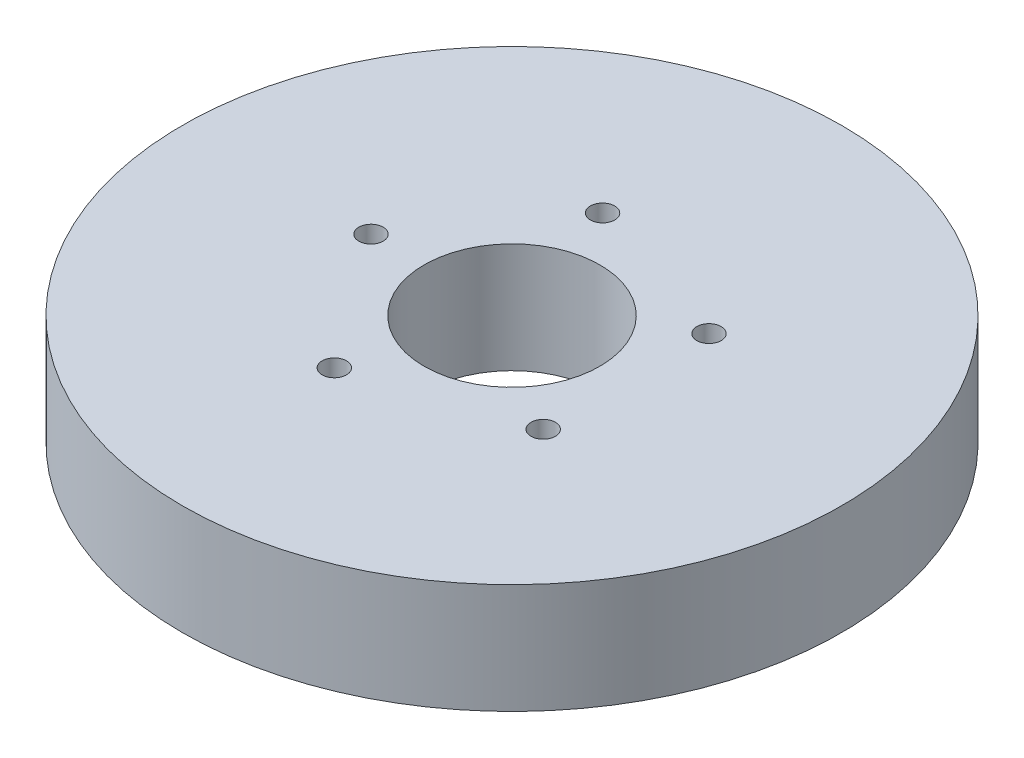
ISO-10303-21;
HEADER;
FILE_DESCRIPTION(('STEP AP214'),'2;1');
FILE_NAME('part.step','',(''),(''),'','','');
FILE_SCHEMA(('AUTOMOTIVE_DESIGN { 1 0 10303 214 1 1 1 1 }'));
ENDSEC;
DATA;
#1=APPLICATION_CONTEXT('core data for automotive mechanical design processes');
#2=APPLICATION_PROTOCOL_DEFINITION('international standard','automotive_design',2000,#1);
#3=PRODUCT_CONTEXT('',#1,'mechanical');
#4=PRODUCT('Part','Part','',(#3));
#5=PRODUCT_RELATED_PRODUCT_CATEGORY('part','',(#4));
#6=PRODUCT_DEFINITION_FORMATION('','',#4);
#7=PRODUCT_DEFINITION_CONTEXT('part definition',#1,'design');
#8=PRODUCT_DEFINITION('design','',#6,#7);
#9=PRODUCT_DEFINITION_SHAPE('','',#8);
#10=(LENGTH_UNIT() NAMED_UNIT(*) SI_UNIT(.MILLI.,.METRE.));
#11=(NAMED_UNIT(*) PLANE_ANGLE_UNIT() SI_UNIT($,.RADIAN.));
#12=(NAMED_UNIT(*) SI_UNIT($,.STERADIAN.) SOLID_ANGLE_UNIT());
#13=UNCERTAINTY_MEASURE_WITH_UNIT(LENGTH_MEASURE(1.E-05),#10,'distance_accuracy_value','');
#14=(GEOMETRIC_REPRESENTATION_CONTEXT(3) GLOBAL_UNCERTAINTY_ASSIGNED_CONTEXT((#13)) GLOBAL_UNIT_ASSIGNED_CONTEXT((#10,
#11,#12)) REPRESENTATION_CONTEXT('',''));
#15=CARTESIAN_POINT('',(0.,0.,0.));
#16=DIRECTION('',(0.,0.,1.));
#17=DIRECTION('',(1.,0.,0.));
#18=AXIS2_PLACEMENT_3D('',#15,#16,#17);
#19=CARTESIAN_POINT('',(0.,25.,0.));
#20=DIRECTION('',(0.,-1.,0.));
#21=DIRECTION('',(0.,0.,-1.));
#22=AXIS2_PLACEMENT_3D('',#19,#20,#21);
#23=CYLINDRICAL_SURFACE('',#22,75.);
#24=CARTESIAN_POINT('',(0.,25.,0.));
#25=DIRECTION('',(0.,1.,0.));
#26=DIRECTION('',(0.,0.,1.));
#27=AXIS2_PLACEMENT_3D('',#24,#25,#26);
#28=CIRCLE('',#27,75.);
#29=CARTESIAN_POINT('',(0.,25.,75.));
#30=VERTEX_POINT('',#29);
#31=EDGE_CURVE('E10',#30,#30,#28,.T.);
#32=ORIENTED_EDGE('',*,*,#31,.F.);
#33=EDGE_LOOP('',(#32));
#34=FACE_BOUND('',#33,.T.);
#35=CARTESIAN_POINT('',(0.,0.,0.));
#36=DIRECTION('',(0.,1.,0.));
#37=DIRECTION('',(0.,0.,1.));
#38=AXIS2_PLACEMENT_3D('',#35,#36,#37);
#39=CIRCLE('',#38,75.);
#40=CARTESIAN_POINT('',(0.,0.,75.));
#41=VERTEX_POINT('',#40);
#42=EDGE_CURVE('E37',#41,#41,#39,.T.);
#43=ORIENTED_EDGE('',*,*,#42,.T.);
#44=EDGE_LOOP('',(#43));
#45=FACE_BOUND('',#44,.T.);
#46=ADVANCED_FACE('F40',(#34,#45),#23,.T.);
#47=CARTESIAN_POINT('',(0.,25.,0.));
#48=DIRECTION('',(0.,1.,0.));
#49=DIRECTION('',(0.,0.,1.));
#50=AXIS2_PLACEMENT_3D('',#47,#48,#49);
#51=PLANE('',#50);
#52=CARTESIAN_POINT('',(-9.91726015513193,25.,30.5221883133339));
#53=DIRECTION('',(0.,1.,0.));
#54=DIRECTION('',(0.951056516295155,0.,0.309016994374945));
#55=AXIS2_PLACEMENT_3D('',#52,#53,#54);
#56=CIRCLE('',#55,2.77384865878085);
#57=CARTESIAN_POINT('',(-9.91726015513193,25.,33.2960369721148));
#58=VERTEX_POINT('',#57);
#59=EDGE_CURVE('E78',#58,#58,#56,.T.);
#60=ORIENTED_EDGE('',*,*,#59,.F.);
#61=EDGE_LOOP('',(#60));
#62=FACE_BOUND('',#61,.T.);
#63=CARTESIAN_POINT('',(25.9637241614108,25.,18.863749788665));
#64=DIRECTION('',(0.,1.,0.));
#65=DIRECTION('',(0.587785252292469,0.,-0.809016994374951));
#66=AXIS2_PLACEMENT_3D('',#63,#64,#65);
#67=CIRCLE('',#66,2.77384865878085);
#68=CARTESIAN_POINT('',(25.9637241614108,25.,21.6375984474459));
#69=VERTEX_POINT('',#68);
#70=EDGE_CURVE('E71',#69,#69,#67,.T.);
#71=ORIENTED_EDGE('',*,*,#70,.F.);
#72=EDGE_LOOP('',(#71));
#73=FACE_BOUND('',#72,.T.);
#74=CARTESIAN_POINT('',(25.9637241614105,25.,-18.8637497886654));
#75=DIRECTION('',(0.,1.,0.));
#76=DIRECTION('',(-0.58778525229248,0.,-0.809016994374942));
#77=AXIS2_PLACEMENT_3D('',#74,#75,#76);
#78=CIRCLE('',#77,2.77384865878085);
#79=CARTESIAN_POINT('',(25.9637241614105,25.,-16.0899011298846));
#80=VERTEX_POINT('',#79);
#81=EDGE_CURVE('E70',#80,#80,#78,.T.);
#82=ORIENTED_EDGE('',*,*,#81,.F.);
#83=EDGE_LOOP('',(#82));
#84=FACE_BOUND('',#83,.T.);
#85=CARTESIAN_POINT('',(-9.91726015513237,25.,-30.5221883133338));
#86=DIRECTION('',(0.,1.,0.));
#87=DIRECTION('',(-0.95105651629515,0.,0.309016994374958));
#88=AXIS2_PLACEMENT_3D('',#85,#86,#87);
#89=CIRCLE('',#88,2.77384865878085);
#90=CARTESIAN_POINT('',(-9.91726015513237,25.,-27.748339654553));
#91=VERTEX_POINT('',#90);
#92=EDGE_CURVE('E61',#91,#91,#89,.T.);
#93=ORIENTED_EDGE('',*,*,#92,.F.);
#94=EDGE_LOOP('',(#93));
#95=FACE_BOUND('',#94,.T.);
#96=CARTESIAN_POINT('',(-32.0929280125573,25.,0.));
#97=DIRECTION('',(0.,1.,0.));
#98=DIRECTION('',(0.,0.,1.));
#99=AXIS2_PLACEMENT_3D('',#96,#97,#98);
#100=CIRCLE('',#99,2.77384865878085);
#101=CARTESIAN_POINT('',(-32.0929280125573,25.,2.77384865878085));
#102=VERTEX_POINT('',#101);
#103=EDGE_CURVE('E54',#102,#102,#100,.T.);
#104=ORIENTED_EDGE('',*,*,#103,.F.);
#105=EDGE_LOOP('',(#104));
#106=FACE_BOUND('',#105,.T.);
#107=CARTESIAN_POINT('',(0.,25.,0.));
#108=DIRECTION('',(0.,1.,0.));
#109=DIRECTION('',(0.,0.,1.));
#110=AXIS2_PLACEMENT_3D('',#107,#108,#109);
#111=CIRCLE('',#110,20.);
#112=CARTESIAN_POINT('',(0.,25.,20.));
#113=VERTEX_POINT('',#112);
#114=EDGE_CURVE('E50',#113,#113,#111,.T.);
#115=ORIENTED_EDGE('',*,*,#114,.F.);
#116=EDGE_LOOP('',(#115));
#117=FACE_BOUND('',#116,.T.);
#118=ORIENTED_EDGE('',*,*,#31,.T.);
#119=EDGE_LOOP('',(#118));
#120=FACE_BOUND('',#119,.T.);
#121=ADVANCED_FACE('F94',(#62,#73,#84,#95,#106,#117,#120),#51,.T.);
#122=CARTESIAN_POINT('',(0.,0.,0.));
#123=DIRECTION('',(0.,1.,0.));
#124=DIRECTION('',(0.,0.,1.));
#125=AXIS2_PLACEMENT_3D('',#122,#123,#124);
#126=PLANE('',#125);
#127=CARTESIAN_POINT('',(0.,0.,0.));
#128=DIRECTION('',(0.,1.,0.));
#129=DIRECTION('',(0.,0.,1.));
#130=AXIS2_PLACEMENT_3D('',#127,#128,#129);
#131=CIRCLE('',#130,20.);
#132=CARTESIAN_POINT('',(0.,0.,20.));
#133=VERTEX_POINT('',#132);
#134=EDGE_CURVE('E47',#133,#133,#131,.T.);
#135=ORIENTED_EDGE('',*,*,#134,.T.);
#136=EDGE_LOOP('',(#135));
#137=FACE_BOUND('',#136,.T.);
#138=ORIENTED_EDGE('',*,*,#42,.F.);
#139=EDGE_LOOP('',(#138));
#140=FACE_BOUND('',#139,.T.);
#141=ADVANCED_FACE('F100',(#137,#140),#126,.F.);
#142=CARTESIAN_POINT('',(0.,25.,0.));
#143=DIRECTION('',(0.,-1.,0.));
#144=DIRECTION('',(0.,0.,-1.));
#145=AXIS2_PLACEMENT_3D('',#142,#143,#144);
#146=CYLINDRICAL_SURFACE('',#145,20.);
#147=ORIENTED_EDGE('',*,*,#114,.T.);
#148=EDGE_LOOP('',(#147));
#149=FACE_BOUND('',#148,.T.);
#150=ORIENTED_EDGE('',*,*,#134,.F.);
#151=EDGE_LOOP('',(#150));
#152=FACE_BOUND('',#151,.T.);
#153=ADVANCED_FACE('F108',(#149,#152),#146,.F.);
#154=CARTESIAN_POINT('',(-32.0929280125573,4.63593323776733,0.));
#155=DIRECTION('',(0.,1.,0.));
#156=DIRECTION('',(0.,0.,1.));
#157=AXIS2_PLACEMENT_3D('',#154,#155,#156);
#158=CYLINDRICAL_SURFACE('',#157,2.77384865878085);
#159=CARTESIAN_POINT('',(-32.0929280125573,4.63593323776733,0.));
#160=DIRECTION('',(0.,1.,0.));
#161=DIRECTION('',(0.,0.,1.));
#162=AXIS2_PLACEMENT_3D('',#159,#160,#161);
#163=CIRCLE('',#162,2.77384865878085);
#164=CARTESIAN_POINT('',(-32.0929280125573,4.63593323776733,2.77384865878085));
#165=VERTEX_POINT('',#164);
#166=EDGE_CURVE('E55',#165,#165,#163,.T.);
#167=CARTESIAN_POINT('',(-32.0929280125573,4.63593323776733,2.77384865878085));
#168=CARTESIAN_POINT('',(-32.0929280125573,4.84805893320726,2.77384865878085));
#169=CARTESIAN_POINT('',(-32.0929280125573,5.06018462864718,2.77384865878085));
#170=CARTESIAN_POINT('',(-32.0929280125573,5.48443601952703,2.77384865878085));
#171=CARTESIAN_POINT('',(-32.0929280125573,5.69656171496695,2.77384865878085));
#172=CARTESIAN_POINT('',(-32.0929280125573,6.1208131058468,2.77384865878085));
#173=CARTESIAN_POINT('',(-32.0929280125573,6.33293880128672,2.77384865878085));
#174=CARTESIAN_POINT('',(-32.0929280125573,6.75719019216657,2.77384865878085));
#175=CARTESIAN_POINT('',(-32.0929280125573,6.96931588760649,2.77384865878085));
#176=CARTESIAN_POINT('',(-32.0929280125573,7.39356727848634,2.77384865878085));
#177=CARTESIAN_POINT('',(-32.0929280125573,7.60569297392626,2.77384865878085));
#178=CARTESIAN_POINT('',(-32.0929280125573,8.02994436480611,2.77384865878085));
#179=CARTESIAN_POINT('',(-32.0929280125573,8.24207006024603,2.77384865878085));
#180=CARTESIAN_POINT('',(-32.0929280125573,8.66632145112588,2.77384865878085));
#181=CARTESIAN_POINT('',(-32.0929280125573,8.8784471465658,2.77384865878085));
#182=CARTESIAN_POINT('',(-32.0929280125573,9.30269853744565,2.77384865878085));
#183=CARTESIAN_POINT('',(-32.0929280125573,9.51482423288557,2.77384865878085));
#184=CARTESIAN_POINT('',(-32.0929280125573,9.93907562376542,2.77384865878085));
#185=CARTESIAN_POINT('',(-32.0929280125573,10.1512013192053,2.77384865878085));
#186=CARTESIAN_POINT('',(-32.0929280125573,10.5754527100852,2.77384865878085));
#187=CARTESIAN_POINT('',(-32.0929280125573,10.7875784055251,2.77384865878085));
#188=CARTESIAN_POINT('',(-32.0929280125573,11.211829796405,2.77384865878085));
#189=CARTESIAN_POINT('',(-32.0929280125573,11.4239554918449,2.77384865878085));
#190=CARTESIAN_POINT('',(-32.0929280125573,11.8482068827247,2.77384865878085));
#191=CARTESIAN_POINT('',(-32.0929280125573,12.0603325781647,2.77384865878085));
#192=CARTESIAN_POINT('',(-32.0929280125573,12.4845839690445,2.77384865878085));
#193=CARTESIAN_POINT('',(-32.0929280125573,12.6967096644844,2.77384865878085));
#194=CARTESIAN_POINT('',(-32.0929280125573,13.1209610553643,2.77384865878085));
#195=CARTESIAN_POINT('',(-32.0929280125573,13.3330867508042,2.77384865878085));
#196=CARTESIAN_POINT('',(-32.0929280125573,13.757338141684,2.77384865878085));
#197=CARTESIAN_POINT('',(-32.0929280125573,13.969463837124,2.77384865878085));
#198=CARTESIAN_POINT('',(-32.0929280125573,14.3937152280038,2.77384865878085));
#199=CARTESIAN_POINT('',(-32.0929280125573,14.6058409234437,2.77384865878085));
#200=CARTESIAN_POINT('',(-32.0929280125573,15.0300923143236,2.77384865878085));
#201=CARTESIAN_POINT('',(-32.0929280125573,15.2422180097635,2.77384865878085));
#202=CARTESIAN_POINT('',(-32.0929280125573,15.6664694006434,2.77384865878085));
#203=CARTESIAN_POINT('',(-32.0929280125573,15.8785950960833,2.77384865878085));
#204=CARTESIAN_POINT('',(-32.0929280125573,16.3028464869631,2.77384865878085));
#205=CARTESIAN_POINT('',(-32.0929280125573,16.5149721824031,2.77384865878085));
#206=CARTESIAN_POINT('',(-32.0929280125573,16.9392235732829,2.77384865878085));
#207=CARTESIAN_POINT('',(-32.0929280125573,17.1513492687228,2.77384865878085));
#208=CARTESIAN_POINT('',(-32.0929280125573,17.5756006596027,2.77384865878085));
#209=CARTESIAN_POINT('',(-32.0929280125573,17.7877263550426,2.77384865878085));
#210=CARTESIAN_POINT('',(-32.0929280125573,18.2119777459224,2.77384865878085));
#211=CARTESIAN_POINT('',(-32.0929280125573,18.4241034413624,2.77384865878085));
#212=CARTESIAN_POINT('',(-32.0929280125573,18.8483548322422,2.77384865878085));
#213=CARTESIAN_POINT('',(-32.0929280125573,19.0604805276821,2.77384865878085));
#214=CARTESIAN_POINT('',(-32.0929280125573,19.484731918562,2.77384865878085));
#215=CARTESIAN_POINT('',(-32.0929280125573,19.6968576140019,2.77384865878085));
#216=CARTESIAN_POINT('',(-32.0929280125573,20.1211090048818,2.77384865878085));
#217=CARTESIAN_POINT('',(-32.0929280125573,20.3332347003217,2.77384865878085));
#218=CARTESIAN_POINT('',(-32.0929280125573,20.7574860912015,2.77384865878085));
#219=CARTESIAN_POINT('',(-32.0929280125573,20.9696117866414,2.77384865878085));
#220=CARTESIAN_POINT('',(-32.0929280125573,21.3938631775213,2.77384865878085));
#221=CARTESIAN_POINT('',(-32.0929280125573,21.6059888729612,2.77384865878085));
#222=CARTESIAN_POINT('',(-32.0929280125573,22.0302402638411,2.77384865878085));
#223=CARTESIAN_POINT('',(-32.0929280125573,22.242365959281,2.77384865878085));
#224=CARTESIAN_POINT('',(-32.0929280125573,22.6666173501608,2.77384865878085));
#225=CARTESIAN_POINT('',(-32.0929280125573,22.8787430456008,2.77384865878085));
#226=CARTESIAN_POINT('',(-32.0929280125573,23.3029944364806,2.77384865878085));
#227=CARTESIAN_POINT('',(-32.0929280125573,23.5151201319205,2.77384865878085));
#228=CARTESIAN_POINT('',(-32.0929280125573,23.9393715228004,2.77384865878085));
#229=CARTESIAN_POINT('',(-32.0929280125573,24.1514972182403,2.77384865878085));
#230=CARTESIAN_POINT('',(-32.0929280125573,24.5757486091202,2.77384865878085));
#231=CARTESIAN_POINT('',(-32.0929280125573,24.7878743045601,2.77384865878085));
#232=CARTESIAN_POINT('',(-32.0929280125573,25.,2.77384865878085));
#233=B_SPLINE_CURVE_WITH_KNOTS('',3,(#167,#168,#169,#170,#171,#172,#173,#174,#175,#176,#177,
#178,#179,#180,#181,#182,#183,#184,#185,#186,#187,#188,#189,#190,#191,#192,#193,#194,#195,#196,
#197,#198,#199,#200,#201,#202,#203,#204,#205,#206,#207,#208,#209,#210,#211,#212,#213,#214,#215,
#216,#217,#218,#219,#220,#221,#222,#223,#224,#225,#226,#227,#228,#229,#230,#231,#232),
.UNSPECIFIED.,.F.,.F.,(4,2,2,2,2,2,2,2,2,2,2,2,2,2,2,2,2,2,2,2,2,2,2,2,2,2,2,2,2,2,2,2,4),(0.,
0.63637708631977,1.27275417263954,1.90913125895931,2.54550834527908,3.18188543159885,
3.81826251791863,4.4546396042384,5.09101669055817,5.72739377687794,6.36377086319771,
7.00014794951748,7.63652503583725,8.27290212215702,8.90927920847679,9.54565629479656,
10.1820333811163,10.8184104674361,11.4547875537559,12.0911646400757,12.7275417263954,
13.3639188127152,14.000295899035,14.6366729853547,15.2730500716745,15.9094271579943,
16.545804244314,17.1821813306338,17.8185584169536,18.4549355032734,19.0913125895931,
19.7276896759129,20.3640667622327),.UNSPECIFIED.);
#234=EDGE_CURVE('BSEAM115',#165,#102,#233,.T.);
#235=ORIENTED_EDGE('',*,*,#166,.F.);
#236=ORIENTED_EDGE('',*,*,#103,.T.);
#237=ORIENTED_EDGE('',*,*,#234,.T.);
#238=ORIENTED_EDGE('',*,*,#234,.F.);
#239=EDGE_LOOP('',(#235,#237,#236,#238));
#240=FACE_BOUND('',#239,.T.);
#241=ADVANCED_FACE('F115',(#240),#158,.F.);
#242=CARTESIAN_POINT('',(-32.0929280125573,4.63593323776733,0.));
#243=DIRECTION('',(0.,1.,0.));
#244=DIRECTION('',(0.,0.,1.));
#245=AXIS2_PLACEMENT_3D('',#242,#243,#244);
#246=PLANE('',#245);
#247=ORIENTED_EDGE('',*,*,#166,.T.);
#248=EDGE_LOOP('',(#247));
#249=FACE_BOUND('',#248,.T.);
#250=ADVANCED_FACE('F142',(#249),#246,.T.);
#251=CARTESIAN_POINT('',(-9.91726015513237,4.63593323776733,-30.5221883133338));
#252=DIRECTION('',(0.,1.,0.));
#253=DIRECTION('',(0.,0.,1.));
#254=AXIS2_PLACEMENT_3D('',#251,#252,#253);
#255=CYLINDRICAL_SURFACE('',#254,2.77384865878085);
#256=CARTESIAN_POINT('',(-9.91726015513237,4.63593323776733,-30.5221883133338));
#257=DIRECTION('',(0.,1.,0.));
#258=DIRECTION('',(-0.95105651629515,0.,0.309016994374958));
#259=AXIS2_PLACEMENT_3D('',#256,#257,#258);
#260=CIRCLE('',#259,2.77384865878085);
#261=CARTESIAN_POINT('',(-9.91726015513237,4.63593323776733,-27.748339654553));
#262=VERTEX_POINT('',#261);
#263=EDGE_CURVE('E63',#262,#262,#260,.T.);
#264=CARTESIAN_POINT('',(-9.91726015513237,4.63593323776733,-27.748339654553));
#265=CARTESIAN_POINT('',(-9.91726015513237,4.84805893320726,-27.748339654553));
#266=CARTESIAN_POINT('',(-9.91726015513237,5.06018462864718,-27.748339654553));
#267=CARTESIAN_POINT('',(-9.91726015513237,5.48443601952703,-27.748339654553));
#268=CARTESIAN_POINT('',(-9.91726015513237,5.69656171496695,-27.748339654553));
#269=CARTESIAN_POINT('',(-9.91726015513237,6.1208131058468,-27.748339654553));
#270=CARTESIAN_POINT('',(-9.91726015513237,6.33293880128672,-27.748339654553));
#271=CARTESIAN_POINT('',(-9.91726015513237,6.75719019216657,-27.748339654553));
#272=CARTESIAN_POINT('',(-9.91726015513237,6.96931588760649,-27.748339654553));
#273=CARTESIAN_POINT('',(-9.91726015513237,7.39356727848634,-27.748339654553));
#274=CARTESIAN_POINT('',(-9.91726015513237,7.60569297392626,-27.748339654553));
#275=CARTESIAN_POINT('',(-9.91726015513237,8.02994436480611,-27.748339654553));
#276=CARTESIAN_POINT('',(-9.91726015513237,8.24207006024603,-27.748339654553));
#277=CARTESIAN_POINT('',(-9.91726015513237,8.66632145112588,-27.748339654553));
#278=CARTESIAN_POINT('',(-9.91726015513237,8.8784471465658,-27.748339654553));
#279=CARTESIAN_POINT('',(-9.91726015513237,9.30269853744565,-27.748339654553));
#280=CARTESIAN_POINT('',(-9.91726015513237,9.51482423288557,-27.748339654553));
#281=CARTESIAN_POINT('',(-9.91726015513237,9.93907562376542,-27.748339654553));
#282=CARTESIAN_POINT('',(-9.91726015513237,10.1512013192053,-27.748339654553));
#283=CARTESIAN_POINT('',(-9.91726015513237,10.5754527100852,-27.748339654553));
#284=CARTESIAN_POINT('',(-9.91726015513237,10.7875784055251,-27.748339654553));
#285=CARTESIAN_POINT('',(-9.91726015513237,11.211829796405,-27.748339654553));
#286=CARTESIAN_POINT('',(-9.91726015513237,11.4239554918449,-27.748339654553));
#287=CARTESIAN_POINT('',(-9.91726015513237,11.8482068827247,-27.748339654553));
#288=CARTESIAN_POINT('',(-9.91726015513237,12.0603325781647,-27.748339654553));
#289=CARTESIAN_POINT('',(-9.91726015513237,12.4845839690445,-27.748339654553));
#290=CARTESIAN_POINT('',(-9.91726015513237,12.6967096644844,-27.748339654553));
#291=CARTESIAN_POINT('',(-9.91726015513237,13.1209610553643,-27.748339654553));
#292=CARTESIAN_POINT('',(-9.91726015513237,13.3330867508042,-27.748339654553));
#293=CARTESIAN_POINT('',(-9.91726015513237,13.757338141684,-27.748339654553));
#294=CARTESIAN_POINT('',(-9.91726015513237,13.969463837124,-27.748339654553));
#295=CARTESIAN_POINT('',(-9.91726015513237,14.3937152280038,-27.748339654553));
#296=CARTESIAN_POINT('',(-9.91726015513237,14.6058409234437,-27.748339654553));
#297=CARTESIAN_POINT('',(-9.91726015513237,15.0300923143236,-27.748339654553));
#298=CARTESIAN_POINT('',(-9.91726015513237,15.2422180097635,-27.748339654553));
#299=CARTESIAN_POINT('',(-9.91726015513237,15.6664694006434,-27.748339654553));
#300=CARTESIAN_POINT('',(-9.91726015513237,15.8785950960833,-27.748339654553));
#301=CARTESIAN_POINT('',(-9.91726015513237,16.3028464869631,-27.748339654553));
#302=CARTESIAN_POINT('',(-9.91726015513237,16.5149721824031,-27.748339654553));
#303=CARTESIAN_POINT('',(-9.91726015513237,16.9392235732829,-27.748339654553));
#304=CARTESIAN_POINT('',(-9.91726015513237,17.1513492687228,-27.748339654553));
#305=CARTESIAN_POINT('',(-9.91726015513237,17.5756006596027,-27.748339654553));
#306=CARTESIAN_POINT('',(-9.91726015513237,17.7877263550426,-27.748339654553));
#307=CARTESIAN_POINT('',(-9.91726015513237,18.2119777459224,-27.748339654553));
#308=CARTESIAN_POINT('',(-9.91726015513237,18.4241034413624,-27.748339654553));
#309=CARTESIAN_POINT('',(-9.91726015513237,18.8483548322422,-27.748339654553));
#310=CARTESIAN_POINT('',(-9.91726015513237,19.0604805276821,-27.748339654553));
#311=CARTESIAN_POINT('',(-9.91726015513237,19.484731918562,-27.748339654553));
#312=CARTESIAN_POINT('',(-9.91726015513237,19.6968576140019,-27.748339654553));
#313=CARTESIAN_POINT('',(-9.91726015513237,20.1211090048818,-27.748339654553));
#314=CARTESIAN_POINT('',(-9.91726015513237,20.3332347003217,-27.748339654553));
#315=CARTESIAN_POINT('',(-9.91726015513237,20.7574860912015,-27.748339654553));
#316=CARTESIAN_POINT('',(-9.91726015513237,20.9696117866414,-27.748339654553));
#317=CARTESIAN_POINT('',(-9.91726015513237,21.3938631775213,-27.748339654553));
#318=CARTESIAN_POINT('',(-9.91726015513237,21.6059888729612,-27.748339654553));
#319=CARTESIAN_POINT('',(-9.91726015513237,22.0302402638411,-27.748339654553));
#320=CARTESIAN_POINT('',(-9.91726015513237,22.242365959281,-27.748339654553));
#321=CARTESIAN_POINT('',(-9.91726015513237,22.6666173501608,-27.748339654553));
#322=CARTESIAN_POINT('',(-9.91726015513237,22.8787430456008,-27.748339654553));
#323=CARTESIAN_POINT('',(-9.91726015513237,23.3029944364806,-27.748339654553));
#324=CARTESIAN_POINT('',(-9.91726015513237,23.5151201319205,-27.748339654553));
#325=CARTESIAN_POINT('',(-9.91726015513237,23.9393715228004,-27.748339654553));
#326=CARTESIAN_POINT('',(-9.91726015513237,24.1514972182403,-27.748339654553));
#327=CARTESIAN_POINT('',(-9.91726015513237,24.5757486091202,-27.748339654553));
#328=CARTESIAN_POINT('',(-9.91726015513237,24.7878743045601,-27.748339654553));
#329=CARTESIAN_POINT('',(-9.91726015513237,25.,-27.748339654553));
#330=B_SPLINE_CURVE_WITH_KNOTS('',3,(#264,#265,#266,#267,#268,#269,#270,#271,#272,#273,#274,
#275,#276,#277,#278,#279,#280,#281,#282,#283,#284,#285,#286,#287,#288,#289,#290,#291,#292,#293,
#294,#295,#296,#297,#298,#299,#300,#301,#302,#303,#304,#305,#306,#307,#308,#309,#310,#311,#312,
#313,#314,#315,#316,#317,#318,#319,#320,#321,#322,#323,#324,#325,#326,#327,#328,#329),
.UNSPECIFIED.,.F.,.F.,(4,2,2,2,2,2,2,2,2,2,2,2,2,2,2,2,2,2,2,2,2,2,2,2,2,2,2,2,2,2,2,2,4),(0.,
0.63637708631977,1.27275417263954,1.90913125895931,2.54550834527908,3.18188543159885,
3.81826251791863,4.4546396042384,5.09101669055817,5.72739377687794,6.36377086319771,
7.00014794951748,7.63652503583725,8.27290212215702,8.90927920847679,9.54565629479656,
10.1820333811163,10.8184104674361,11.4547875537559,12.0911646400757,12.7275417263954,
13.3639188127152,14.000295899035,14.6366729853547,15.2730500716745,15.9094271579943,
16.545804244314,17.1821813306338,17.8185584169536,18.4549355032734,19.0913125895931,
19.7276896759129,20.3640667622327),.UNSPECIFIED.);
#331=EDGE_CURVE('BSEAM147',#262,#91,#330,.T.);
#332=ORIENTED_EDGE('',*,*,#263,.F.);
#333=ORIENTED_EDGE('',*,*,#92,.T.);
#334=ORIENTED_EDGE('',*,*,#331,.T.);
#335=ORIENTED_EDGE('',*,*,#331,.F.);
#336=EDGE_LOOP('',(#332,#334,#333,#335));
#337=FACE_BOUND('',#336,.T.);
#338=ADVANCED_FACE('F147',(#337),#255,.F.);
#339=CARTESIAN_POINT('',(-9.91726015513237,4.63593323776733,-30.5221883133338));
#340=DIRECTION('',(0.,1.,0.));
#341=DIRECTION('',(-0.95105651629515,0.,0.309016994374958));
#342=AXIS2_PLACEMENT_3D('',#339,#340,#341);
#343=PLANE('',#342);
#344=ORIENTED_EDGE('',*,*,#263,.T.);
#345=EDGE_LOOP('',(#344));
#346=FACE_BOUND('',#345,.T.);
#347=ADVANCED_FACE('F163',(#346),#343,.T.);
#348=CARTESIAN_POINT('',(25.9637241614105,4.63593323776733,-18.8637497886654));
#349=DIRECTION('',(0.,1.,0.));
#350=DIRECTION('',(0.,0.,1.));
#351=AXIS2_PLACEMENT_3D('',#348,#349,#350);
#352=CYLINDRICAL_SURFACE('',#351,2.77384865878085);
#353=CARTESIAN_POINT('',(25.9637241614105,4.63593323776733,-18.8637497886654));
#354=DIRECTION('',(0.,1.,0.));
#355=DIRECTION('',(-0.58778525229248,0.,-0.809016994374942));
#356=AXIS2_PLACEMENT_3D('',#353,#354,#355);
#357=CIRCLE('',#356,2.77384865878085);
#358=CARTESIAN_POINT('',(25.9637241614105,4.63593323776733,-16.0899011298846));
#359=VERTEX_POINT('',#358);
#360=EDGE_CURVE('E69',#359,#359,#357,.T.);
#361=CARTESIAN_POINT('',(25.9637241614105,4.63593323776733,-16.0899011298846));
#362=CARTESIAN_POINT('',(25.9637241614105,4.84805893320726,-16.0899011298846));
#363=CARTESIAN_POINT('',(25.9637241614105,5.06018462864718,-16.0899011298846));
#364=CARTESIAN_POINT('',(25.9637241614105,5.48443601952703,-16.0899011298846));
#365=CARTESIAN_POINT('',(25.9637241614105,5.69656171496695,-16.0899011298846));
#366=CARTESIAN_POINT('',(25.9637241614105,6.1208131058468,-16.0899011298846));
#367=CARTESIAN_POINT('',(25.9637241614105,6.33293880128672,-16.0899011298846));
#368=CARTESIAN_POINT('',(25.9637241614105,6.75719019216657,-16.0899011298846));
#369=CARTESIAN_POINT('',(25.9637241614105,6.96931588760649,-16.0899011298846));
#370=CARTESIAN_POINT('',(25.9637241614105,7.39356727848634,-16.0899011298846));
#371=CARTESIAN_POINT('',(25.9637241614105,7.60569297392626,-16.0899011298846));
#372=CARTESIAN_POINT('',(25.9637241614105,8.02994436480611,-16.0899011298846));
#373=CARTESIAN_POINT('',(25.9637241614105,8.24207006024603,-16.0899011298846));
#374=CARTESIAN_POINT('',(25.9637241614105,8.66632145112588,-16.0899011298846));
#375=CARTESIAN_POINT('',(25.9637241614105,8.8784471465658,-16.0899011298846));
#376=CARTESIAN_POINT('',(25.9637241614105,9.30269853744565,-16.0899011298846));
#377=CARTESIAN_POINT('',(25.9637241614105,9.51482423288557,-16.0899011298846));
#378=CARTESIAN_POINT('',(25.9637241614105,9.93907562376542,-16.0899011298846));
#379=CARTESIAN_POINT('',(25.9637241614105,10.1512013192053,-16.0899011298846));
#380=CARTESIAN_POINT('',(25.9637241614105,10.5754527100852,-16.0899011298846));
#381=CARTESIAN_POINT('',(25.9637241614105,10.7875784055251,-16.0899011298846));
#382=CARTESIAN_POINT('',(25.9637241614105,11.211829796405,-16.0899011298846));
#383=CARTESIAN_POINT('',(25.9637241614105,11.4239554918449,-16.0899011298846));
#384=CARTESIAN_POINT('',(25.9637241614105,11.8482068827247,-16.0899011298846));
#385=CARTESIAN_POINT('',(25.9637241614105,12.0603325781647,-16.0899011298846));
#386=CARTESIAN_POINT('',(25.9637241614105,12.4845839690445,-16.0899011298846));
#387=CARTESIAN_POINT('',(25.9637241614105,12.6967096644844,-16.0899011298846));
#388=CARTESIAN_POINT('',(25.9637241614105,13.1209610553643,-16.0899011298846));
#389=CARTESIAN_POINT('',(25.9637241614105,13.3330867508042,-16.0899011298846));
#390=CARTESIAN_POINT('',(25.9637241614105,13.757338141684,-16.0899011298846));
#391=CARTESIAN_POINT('',(25.9637241614105,13.969463837124,-16.0899011298846));
#392=CARTESIAN_POINT('',(25.9637241614105,14.3937152280038,-16.0899011298846));
#393=CARTESIAN_POINT('',(25.9637241614105,14.6058409234437,-16.0899011298846));
#394=CARTESIAN_POINT('',(25.9637241614105,15.0300923143236,-16.0899011298846));
#395=CARTESIAN_POINT('',(25.9637241614105,15.2422180097635,-16.0899011298846));
#396=CARTESIAN_POINT('',(25.9637241614105,15.6664694006434,-16.0899011298846));
#397=CARTESIAN_POINT('',(25.9637241614105,15.8785950960833,-16.0899011298846));
#398=CARTESIAN_POINT('',(25.9637241614105,16.3028464869631,-16.0899011298846));
#399=CARTESIAN_POINT('',(25.9637241614105,16.5149721824031,-16.0899011298846));
#400=CARTESIAN_POINT('',(25.9637241614105,16.9392235732829,-16.0899011298846));
#401=CARTESIAN_POINT('',(25.9637241614105,17.1513492687228,-16.0899011298846));
#402=CARTESIAN_POINT('',(25.9637241614105,17.5756006596027,-16.0899011298846));
#403=CARTESIAN_POINT('',(25.9637241614105,17.7877263550426,-16.0899011298846));
#404=CARTESIAN_POINT('',(25.9637241614105,18.2119777459224,-16.0899011298846));
#405=CARTESIAN_POINT('',(25.9637241614105,18.4241034413624,-16.0899011298846));
#406=CARTESIAN_POINT('',(25.9637241614105,18.8483548322422,-16.0899011298846));
#407=CARTESIAN_POINT('',(25.9637241614105,19.0604805276821,-16.0899011298846));
#408=CARTESIAN_POINT('',(25.9637241614105,19.484731918562,-16.0899011298846));
#409=CARTESIAN_POINT('',(25.9637241614105,19.6968576140019,-16.0899011298846));
#410=CARTESIAN_POINT('',(25.9637241614105,20.1211090048818,-16.0899011298846));
#411=CARTESIAN_POINT('',(25.9637241614105,20.3332347003217,-16.0899011298846));
#412=CARTESIAN_POINT('',(25.9637241614105,20.7574860912015,-16.0899011298846));
#413=CARTESIAN_POINT('',(25.9637241614105,20.9696117866414,-16.0899011298846));
#414=CARTESIAN_POINT('',(25.9637241614105,21.3938631775213,-16.0899011298846));
#415=CARTESIAN_POINT('',(25.9637241614105,21.6059888729612,-16.0899011298846));
#416=CARTESIAN_POINT('',(25.9637241614105,22.0302402638411,-16.0899011298846));
#417=CARTESIAN_POINT('',(25.9637241614105,22.242365959281,-16.0899011298846));
#418=CARTESIAN_POINT('',(25.9637241614105,22.6666173501608,-16.0899011298846));
#419=CARTESIAN_POINT('',(25.9637241614105,22.8787430456008,-16.0899011298846));
#420=CARTESIAN_POINT('',(25.9637241614105,23.3029944364806,-16.0899011298846));
#421=CARTESIAN_POINT('',(25.9637241614105,23.5151201319205,-16.0899011298846));
#422=CARTESIAN_POINT('',(25.9637241614105,23.9393715228004,-16.0899011298846));
#423=CARTESIAN_POINT('',(25.9637241614105,24.1514972182403,-16.0899011298846));
#424=CARTESIAN_POINT('',(25.9637241614105,24.5757486091202,-16.0899011298846));
#425=CARTESIAN_POINT('',(25.9637241614105,24.7878743045601,-16.0899011298846));
#426=CARTESIAN_POINT('',(25.9637241614105,25.,-16.0899011298846));
#427=B_SPLINE_CURVE_WITH_KNOTS('',3,(#361,#362,#363,#364,#365,#366,#367,#368,#369,#370,#371,
#372,#373,#374,#375,#376,#377,#378,#379,#380,#381,#382,#383,#384,#385,#386,#387,#388,#389,#390,
#391,#392,#393,#394,#395,#396,#397,#398,#399,#400,#401,#402,#403,#404,#405,#406,#407,#408,#409,
#410,#411,#412,#413,#414,#415,#416,#417,#418,#419,#420,#421,#422,#423,#424,#425,#426),
.UNSPECIFIED.,.F.,.F.,(4,2,2,2,2,2,2,2,2,2,2,2,2,2,2,2,2,2,2,2,2,2,2,2,2,2,2,2,2,2,2,2,4),(0.,
0.63637708631977,1.27275417263954,1.90913125895931,2.54550834527908,3.18188543159885,
3.81826251791863,4.4546396042384,5.09101669055817,5.72739377687794,6.36377086319771,
7.00014794951748,7.63652503583725,8.27290212215702,8.90927920847679,9.54565629479656,
10.1820333811163,10.8184104674361,11.4547875537559,12.0911646400757,12.7275417263954,
13.3639188127152,14.000295899035,14.6366729853547,15.2730500716745,15.9094271579943,
16.545804244314,17.1821813306338,17.8185584169536,18.4549355032734,19.0913125895931,
19.7276896759129,20.3640667622327),.UNSPECIFIED.);
#428=EDGE_CURVE('BSEAM172',#359,#80,#427,.T.);
#429=ORIENTED_EDGE('',*,*,#360,.F.);
#430=ORIENTED_EDGE('',*,*,#81,.T.);
#431=ORIENTED_EDGE('',*,*,#428,.T.);
#432=ORIENTED_EDGE('',*,*,#428,.F.);
#433=EDGE_LOOP('',(#429,#431,#430,#432));
#434=FACE_BOUND('',#433,.T.);
#435=ADVANCED_FACE('F172',(#434),#352,.F.);
#436=CARTESIAN_POINT('',(25.9637241614105,4.63593323776733,-18.8637497886654));
#437=DIRECTION('',(0.,1.,0.));
#438=DIRECTION('',(-0.58778525229248,0.,-0.809016994374942));
#439=AXIS2_PLACEMENT_3D('',#436,#437,#438);
#440=PLANE('',#439);
#441=ORIENTED_EDGE('',*,*,#360,.T.);
#442=EDGE_LOOP('',(#441));
#443=FACE_BOUND('',#442,.T.);
#444=ADVANCED_FACE('F185',(#443),#440,.T.);
#445=CARTESIAN_POINT('',(25.9637241614108,4.63593323776733,18.863749788665));
#446=DIRECTION('',(0.,1.,0.));
#447=DIRECTION('',(0.,0.,1.));
#448=AXIS2_PLACEMENT_3D('',#445,#446,#447);
#449=CYLINDRICAL_SURFACE('',#448,2.77384865878085);
#450=CARTESIAN_POINT('',(25.9637241614108,4.63593323776733,18.863749788665));
#451=DIRECTION('',(0.,1.,0.));
#452=DIRECTION('',(0.587785252292469,0.,-0.809016994374951));
#453=AXIS2_PLACEMENT_3D('',#450,#451,#452);
#454=CIRCLE('',#453,2.77384865878085);
#455=CARTESIAN_POINT('',(25.9637241614108,4.63593323776733,21.6375984474459));
#456=VERTEX_POINT('',#455);
#457=EDGE_CURVE('E76',#456,#456,#454,.T.);
#458=CARTESIAN_POINT('',(25.9637241614108,4.63593323776733,21.6375984474459));
#459=CARTESIAN_POINT('',(25.9637241614108,4.84805893320726,21.6375984474459));
#460=CARTESIAN_POINT('',(25.9637241614108,5.06018462864718,21.6375984474459));
#461=CARTESIAN_POINT('',(25.9637241614108,5.48443601952703,21.6375984474459));
#462=CARTESIAN_POINT('',(25.9637241614108,5.69656171496695,21.6375984474459));
#463=CARTESIAN_POINT('',(25.9637241614108,6.1208131058468,21.6375984474459));
#464=CARTESIAN_POINT('',(25.9637241614108,6.33293880128672,21.6375984474459));
#465=CARTESIAN_POINT('',(25.9637241614108,6.75719019216657,21.6375984474459));
#466=CARTESIAN_POINT('',(25.9637241614108,6.96931588760649,21.6375984474459));
#467=CARTESIAN_POINT('',(25.9637241614108,7.39356727848634,21.6375984474459));
#468=CARTESIAN_POINT('',(25.9637241614108,7.60569297392626,21.6375984474459));
#469=CARTESIAN_POINT('',(25.9637241614108,8.02994436480611,21.6375984474459));
#470=CARTESIAN_POINT('',(25.9637241614108,8.24207006024603,21.6375984474459));
#471=CARTESIAN_POINT('',(25.9637241614108,8.66632145112588,21.6375984474459));
#472=CARTESIAN_POINT('',(25.9637241614108,8.8784471465658,21.6375984474459));
#473=CARTESIAN_POINT('',(25.9637241614108,9.30269853744565,21.6375984474459));
#474=CARTESIAN_POINT('',(25.9637241614108,9.51482423288557,21.6375984474459));
#475=CARTESIAN_POINT('',(25.9637241614108,9.93907562376542,21.6375984474459));
#476=CARTESIAN_POINT('',(25.9637241614108,10.1512013192053,21.6375984474459));
#477=CARTESIAN_POINT('',(25.9637241614108,10.5754527100852,21.6375984474459));
#478=CARTESIAN_POINT('',(25.9637241614108,10.7875784055251,21.6375984474459));
#479=CARTESIAN_POINT('',(25.9637241614108,11.211829796405,21.6375984474459));
#480=CARTESIAN_POINT('',(25.9637241614108,11.4239554918449,21.6375984474459));
#481=CARTESIAN_POINT('',(25.9637241614108,11.8482068827247,21.6375984474459));
#482=CARTESIAN_POINT('',(25.9637241614108,12.0603325781647,21.6375984474459));
#483=CARTESIAN_POINT('',(25.9637241614108,12.4845839690445,21.6375984474459));
#484=CARTESIAN_POINT('',(25.9637241614108,12.6967096644844,21.6375984474459));
#485=CARTESIAN_POINT('',(25.9637241614108,13.1209610553643,21.6375984474459));
#486=CARTESIAN_POINT('',(25.9637241614108,13.3330867508042,21.6375984474459));
#487=CARTESIAN_POINT('',(25.9637241614108,13.757338141684,21.6375984474459));
#488=CARTESIAN_POINT('',(25.9637241614108,13.969463837124,21.6375984474459));
#489=CARTESIAN_POINT('',(25.9637241614108,14.3937152280038,21.6375984474459));
#490=CARTESIAN_POINT('',(25.9637241614108,14.6058409234437,21.6375984474459));
#491=CARTESIAN_POINT('',(25.9637241614108,15.0300923143236,21.6375984474459));
#492=CARTESIAN_POINT('',(25.9637241614108,15.2422180097635,21.6375984474459));
#493=CARTESIAN_POINT('',(25.9637241614108,15.6664694006434,21.6375984474459));
#494=CARTESIAN_POINT('',(25.9637241614108,15.8785950960833,21.6375984474459));
#495=CARTESIAN_POINT('',(25.9637241614108,16.3028464869631,21.6375984474459));
#496=CARTESIAN_POINT('',(25.9637241614108,16.5149721824031,21.6375984474459));
#497=CARTESIAN_POINT('',(25.9637241614108,16.9392235732829,21.6375984474459));
#498=CARTESIAN_POINT('',(25.9637241614108,17.1513492687228,21.6375984474459));
#499=CARTESIAN_POINT('',(25.9637241614108,17.5756006596027,21.6375984474459));
#500=CARTESIAN_POINT('',(25.9637241614108,17.7877263550426,21.6375984474459));
#501=CARTESIAN_POINT('',(25.9637241614108,18.2119777459224,21.6375984474459));
#502=CARTESIAN_POINT('',(25.9637241614108,18.4241034413624,21.6375984474459));
#503=CARTESIAN_POINT('',(25.9637241614108,18.8483548322422,21.6375984474459));
#504=CARTESIAN_POINT('',(25.9637241614108,19.0604805276821,21.6375984474459));
#505=CARTESIAN_POINT('',(25.9637241614108,19.484731918562,21.6375984474459));
#506=CARTESIAN_POINT('',(25.9637241614108,19.6968576140019,21.6375984474459));
#507=CARTESIAN_POINT('',(25.9637241614108,20.1211090048818,21.6375984474459));
#508=CARTESIAN_POINT('',(25.9637241614108,20.3332347003217,21.6375984474459));
#509=CARTESIAN_POINT('',(25.9637241614108,20.7574860912015,21.6375984474459));
#510=CARTESIAN_POINT('',(25.9637241614108,20.9696117866414,21.6375984474459));
#511=CARTESIAN_POINT('',(25.9637241614108,21.3938631775213,21.6375984474459));
#512=CARTESIAN_POINT('',(25.9637241614108,21.6059888729612,21.6375984474459));
#513=CARTESIAN_POINT('',(25.9637241614108,22.0302402638411,21.6375984474459));
#514=CARTESIAN_POINT('',(25.9637241614108,22.242365959281,21.6375984474459));
#515=CARTESIAN_POINT('',(25.9637241614108,22.6666173501608,21.6375984474459));
#516=CARTESIAN_POINT('',(25.9637241614108,22.8787430456008,21.6375984474459));
#517=CARTESIAN_POINT('',(25.9637241614108,23.3029944364806,21.6375984474459));
#518=CARTESIAN_POINT('',(25.9637241614108,23.5151201319205,21.6375984474459));
#519=CARTESIAN_POINT('',(25.9637241614108,23.9393715228004,21.6375984474459));
#520=CARTESIAN_POINT('',(25.9637241614108,24.1514972182403,21.6375984474459));
#521=CARTESIAN_POINT('',(25.9637241614108,24.5757486091202,21.6375984474459));
#522=CARTESIAN_POINT('',(25.9637241614108,24.7878743045601,21.6375984474459));
#523=CARTESIAN_POINT('',(25.9637241614108,25.,21.6375984474459));
#524=B_SPLINE_CURVE_WITH_KNOTS('',3,(#458,#459,#460,#461,#462,#463,#464,#465,#466,#467,#468,
#469,#470,#471,#472,#473,#474,#475,#476,#477,#478,#479,#480,#481,#482,#483,#484,#485,#486,#487,
#488,#489,#490,#491,#492,#493,#494,#495,#496,#497,#498,#499,#500,#501,#502,#503,#504,#505,#506,
#507,#508,#509,#510,#511,#512,#513,#514,#515,#516,#517,#518,#519,#520,#521,#522,#523),
.UNSPECIFIED.,.F.,.F.,(4,2,2,2,2,2,2,2,2,2,2,2,2,2,2,2,2,2,2,2,2,2,2,2,2,2,2,2,2,2,2,2,4),(0.,
0.63637708631977,1.27275417263954,1.90913125895931,2.54550834527908,3.18188543159885,
3.81826251791863,4.4546396042384,5.09101669055817,5.72739377687794,6.36377086319771,
7.00014794951748,7.63652503583725,8.27290212215702,8.90927920847679,9.54565629479656,
10.1820333811163,10.8184104674361,11.4547875537559,12.0911646400757,12.7275417263954,
13.3639188127152,14.000295899035,14.6366729853547,15.2730500716745,15.9094271579943,
16.545804244314,17.1821813306338,17.8185584169536,18.4549355032734,19.0913125895931,
19.7276896759129,20.3640667622327),.UNSPECIFIED.);
#525=EDGE_CURVE('BSEAM191',#456,#69,#524,.T.);
#526=ORIENTED_EDGE('',*,*,#457,.F.);
#527=ORIENTED_EDGE('',*,*,#70,.T.);
#528=ORIENTED_EDGE('',*,*,#525,.T.);
#529=ORIENTED_EDGE('',*,*,#525,.F.);
#530=EDGE_LOOP('',(#526,#528,#527,#529));
#531=FACE_BOUND('',#530,.T.);
#532=ADVANCED_FACE('F191',(#531),#449,.F.);
#533=CARTESIAN_POINT('',(25.9637241614108,4.63593323776733,18.863749788665));
#534=DIRECTION('',(0.,1.,0.));
#535=DIRECTION('',(0.587785252292469,0.,-0.809016994374951));
#536=AXIS2_PLACEMENT_3D('',#533,#534,#535);
#537=PLANE('',#536);
#538=ORIENTED_EDGE('',*,*,#457,.T.);
#539=EDGE_LOOP('',(#538));
#540=FACE_BOUND('',#539,.T.);
#541=ADVANCED_FACE('F89',(#540),#537,.T.);
#542=CARTESIAN_POINT('',(-9.91726015513193,4.63593323776733,30.5221883133339));
#543=DIRECTION('',(0.,1.,0.));
#544=DIRECTION('',(0.,0.,1.));
#545=AXIS2_PLACEMENT_3D('',#542,#543,#544);
#546=CYLINDRICAL_SURFACE('',#545,2.77384865878085);
#547=CARTESIAN_POINT('',(-9.91726015513193,4.63593323776733,30.5221883133339));
#548=DIRECTION('',(0.,1.,0.));
#549=DIRECTION('',(0.951056516295155,0.,0.309016994374945));
#550=AXIS2_PLACEMENT_3D('',#547,#548,#549);
#551=CIRCLE('',#550,2.77384865878085);
#552=CARTESIAN_POINT('',(-9.91726015513193,4.63593323776733,33.2960369721148));
#553=VERTEX_POINT('',#552);
#554=EDGE_CURVE('E59',#553,#553,#551,.T.);
#555=CARTESIAN_POINT('',(-9.91726015513193,4.63593323776733,33.2960369721148));
#556=CARTESIAN_POINT('',(-9.91726015513193,4.84805893320726,33.2960369721148));
#557=CARTESIAN_POINT('',(-9.91726015513193,5.06018462864718,33.2960369721148));
#558=CARTESIAN_POINT('',(-9.91726015513193,5.48443601952703,33.2960369721148));
#559=CARTESIAN_POINT('',(-9.91726015513193,5.69656171496695,33.2960369721148));
#560=CARTESIAN_POINT('',(-9.91726015513193,6.1208131058468,33.2960369721148));
#561=CARTESIAN_POINT('',(-9.91726015513193,6.33293880128672,33.2960369721148));
#562=CARTESIAN_POINT('',(-9.91726015513193,6.75719019216657,33.2960369721148));
#563=CARTESIAN_POINT('',(-9.91726015513193,6.96931588760649,33.2960369721148));
#564=CARTESIAN_POINT('',(-9.91726015513193,7.39356727848634,33.2960369721148));
#565=CARTESIAN_POINT('',(-9.91726015513193,7.60569297392626,33.2960369721148));
#566=CARTESIAN_POINT('',(-9.91726015513193,8.02994436480611,33.2960369721148));
#567=CARTESIAN_POINT('',(-9.91726015513193,8.24207006024603,33.2960369721148));
#568=CARTESIAN_POINT('',(-9.91726015513193,8.66632145112588,33.2960369721148));
#569=CARTESIAN_POINT('',(-9.91726015513193,8.8784471465658,33.2960369721148));
#570=CARTESIAN_POINT('',(-9.91726015513193,9.30269853744565,33.2960369721148));
#571=CARTESIAN_POINT('',(-9.91726015513193,9.51482423288557,33.2960369721148));
#572=CARTESIAN_POINT('',(-9.91726015513193,9.93907562376542,33.2960369721148));
#573=CARTESIAN_POINT('',(-9.91726015513193,10.1512013192053,33.2960369721148));
#574=CARTESIAN_POINT('',(-9.91726015513193,10.5754527100852,33.2960369721148));
#575=CARTESIAN_POINT('',(-9.91726015513193,10.7875784055251,33.2960369721148));
#576=CARTESIAN_POINT('',(-9.91726015513193,11.211829796405,33.2960369721148));
#577=CARTESIAN_POINT('',(-9.91726015513193,11.4239554918449,33.2960369721148));
#578=CARTESIAN_POINT('',(-9.91726015513193,11.8482068827247,33.2960369721148));
#579=CARTESIAN_POINT('',(-9.91726015513193,12.0603325781647,33.2960369721148));
#580=CARTESIAN_POINT('',(-9.91726015513193,12.4845839690445,33.2960369721148));
#581=CARTESIAN_POINT('',(-9.91726015513193,12.6967096644844,33.2960369721148));
#582=CARTESIAN_POINT('',(-9.91726015513193,13.1209610553643,33.2960369721148));
#583=CARTESIAN_POINT('',(-9.91726015513193,13.3330867508042,33.2960369721148));
#584=CARTESIAN_POINT('',(-9.91726015513193,13.757338141684,33.2960369721148));
#585=CARTESIAN_POINT('',(-9.91726015513193,13.969463837124,33.2960369721148));
#586=CARTESIAN_POINT('',(-9.91726015513193,14.3937152280038,33.2960369721148));
#587=CARTESIAN_POINT('',(-9.91726015513193,14.6058409234437,33.2960369721148));
#588=CARTESIAN_POINT('',(-9.91726015513193,15.0300923143236,33.2960369721148));
#589=CARTESIAN_POINT('',(-9.91726015513193,15.2422180097635,33.2960369721148));
#590=CARTESIAN_POINT('',(-9.91726015513193,15.6664694006434,33.2960369721148));
#591=CARTESIAN_POINT('',(-9.91726015513193,15.8785950960833,33.2960369721148));
#592=CARTESIAN_POINT('',(-9.91726015513193,16.3028464869631,33.2960369721148));
#593=CARTESIAN_POINT('',(-9.91726015513193,16.5149721824031,33.2960369721148));
#594=CARTESIAN_POINT('',(-9.91726015513193,16.9392235732829,33.2960369721148));
#595=CARTESIAN_POINT('',(-9.91726015513193,17.1513492687228,33.2960369721148));
#596=CARTESIAN_POINT('',(-9.91726015513193,17.5756006596027,33.2960369721148));
#597=CARTESIAN_POINT('',(-9.91726015513193,17.7877263550426,33.2960369721148));
#598=CARTESIAN_POINT('',(-9.91726015513193,18.2119777459224,33.2960369721148));
#599=CARTESIAN_POINT('',(-9.91726015513193,18.4241034413624,33.2960369721148));
#600=CARTESIAN_POINT('',(-9.91726015513193,18.8483548322422,33.2960369721148));
#601=CARTESIAN_POINT('',(-9.91726015513193,19.0604805276821,33.2960369721148));
#602=CARTESIAN_POINT('',(-9.91726015513193,19.484731918562,33.2960369721148));
#603=CARTESIAN_POINT('',(-9.91726015513193,19.6968576140019,33.2960369721148));
#604=CARTESIAN_POINT('',(-9.91726015513193,20.1211090048818,33.2960369721148));
#605=CARTESIAN_POINT('',(-9.91726015513193,20.3332347003217,33.2960369721148));
#606=CARTESIAN_POINT('',(-9.91726015513193,20.7574860912015,33.2960369721148));
#607=CARTESIAN_POINT('',(-9.91726015513193,20.9696117866414,33.2960369721148));
#608=CARTESIAN_POINT('',(-9.91726015513193,21.3938631775213,33.2960369721148));
#609=CARTESIAN_POINT('',(-9.91726015513193,21.6059888729612,33.2960369721148));
#610=CARTESIAN_POINT('',(-9.91726015513193,22.0302402638411,33.2960369721148));
#611=CARTESIAN_POINT('',(-9.91726015513193,22.242365959281,33.2960369721148));
#612=CARTESIAN_POINT('',(-9.91726015513193,22.6666173501608,33.2960369721148));
#613=CARTESIAN_POINT('',(-9.91726015513193,22.8787430456008,33.2960369721148));
#614=CARTESIAN_POINT('',(-9.91726015513193,23.3029944364806,33.2960369721148));
#615=CARTESIAN_POINT('',(-9.91726015513193,23.5151201319205,33.2960369721148));
#616=CARTESIAN_POINT('',(-9.91726015513193,23.9393715228004,33.2960369721148));
#617=CARTESIAN_POINT('',(-9.91726015513193,24.1514972182403,33.2960369721148));
#618=CARTESIAN_POINT('',(-9.91726015513193,24.5757486091202,33.2960369721148));
#619=CARTESIAN_POINT('',(-9.91726015513193,24.7878743045601,33.2960369721148));
#620=CARTESIAN_POINT('',(-9.91726015513193,25.,33.2960369721148));
#621=B_SPLINE_CURVE_WITH_KNOTS('',3,(#555,#556,#557,#558,#559,#560,#561,#562,#563,#564,#565,
#566,#567,#568,#569,#570,#571,#572,#573,#574,#575,#576,#577,#578,#579,#580,#581,#582,#583,#584,
#585,#586,#587,#588,#589,#590,#591,#592,#593,#594,#595,#596,#597,#598,#599,#600,#601,#602,#603,
#604,#605,#606,#607,#608,#609,#610,#611,#612,#613,#614,#615,#616,#617,#618,#619,#620),
.UNSPECIFIED.,.F.,.F.,(4,2,2,2,2,2,2,2,2,2,2,2,2,2,2,2,2,2,2,2,2,2,2,2,2,2,2,2,2,2,2,2,4),(0.,
0.63637708631977,1.27275417263954,1.90913125895931,2.54550834527908,3.18188543159885,
3.81826251791863,4.4546396042384,5.09101669055817,5.72739377687794,6.36377086319771,
7.00014794951748,7.63652503583725,8.27290212215702,8.90927920847679,9.54565629479656,
10.1820333811163,10.8184104674361,11.4547875537559,12.0911646400757,12.7275417263954,
13.3639188127152,14.000295899035,14.6366729853547,15.2730500716745,15.9094271579943,
16.545804244314,17.1821813306338,17.8185584169536,18.4549355032734,19.0913125895931,
19.7276896759129,20.3640667622327),.UNSPECIFIED.);
#622=EDGE_CURVE('BSEAM87',#553,#58,#621,.T.);
#623=ORIENTED_EDGE('',*,*,#554,.F.);
#624=ORIENTED_EDGE('',*,*,#59,.T.);
#625=ORIENTED_EDGE('',*,*,#622,.T.);
#626=ORIENTED_EDGE('',*,*,#622,.F.);
#627=EDGE_LOOP('',(#623,#625,#624,#626));
#628=FACE_BOUND('',#627,.T.);
#629=ADVANCED_FACE('F87',(#628),#546,.F.);
#630=CARTESIAN_POINT('',(-9.91726015513193,4.63593323776733,30.5221883133339));
#631=DIRECTION('',(0.,1.,0.));
#632=DIRECTION('',(0.951056516295155,0.,0.309016994374945));
#633=AXIS2_PLACEMENT_3D('',#630,#631,#632);
#634=PLANE('',#633);
#635=ORIENTED_EDGE('',*,*,#554,.T.);
#636=EDGE_LOOP('',(#635));
#637=FACE_BOUND('',#636,.T.);
#638=ADVANCED_FACE('F84',(#637),#634,.T.);
#639=CLOSED_SHELL('',(#46,#121,#141,#153,#241,#250,#338,#347,#435,#444,#532,#541,#629,#638));
#640=MANIFOLD_SOLID_BREP('B2',#639);
#641=ADVANCED_BREP_SHAPE_REPRESENTATION('',(#18,#640),#14);
#642=SHAPE_DEFINITION_REPRESENTATION(#9,#641);
ENDSEC;
END-ISO-10303-21;
